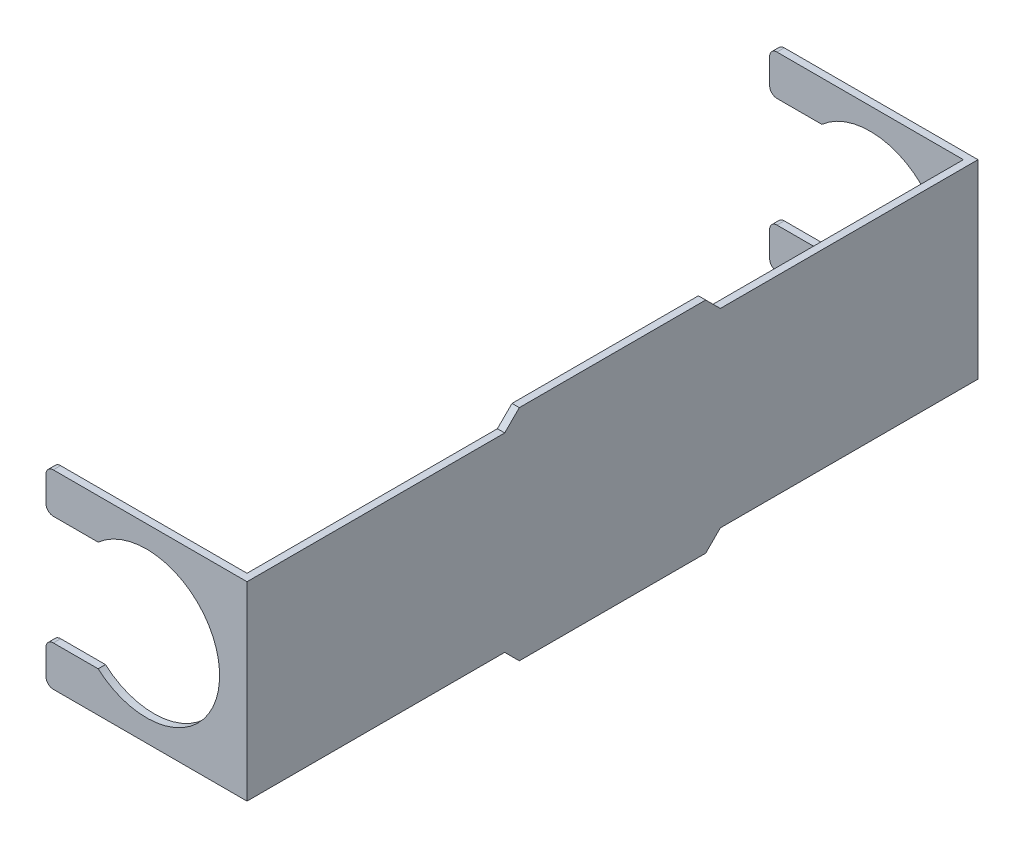
ISO-10303-21;
HEADER;
FILE_DESCRIPTION(('STEP AP214'),'2;1');
FILE_NAME('part.step','',(''),(''),'','','');
FILE_SCHEMA(('AUTOMOTIVE_DESIGN { 1 0 10303 214 1 1 1 1 }'));
ENDSEC;
DATA;
#1=APPLICATION_CONTEXT('core data for automotive mechanical design processes');
#2=APPLICATION_PROTOCOL_DEFINITION('international standard','automotive_design',2000,#1);
#3=PRODUCT_CONTEXT('',#1,'mechanical');
#4=PRODUCT('Part','Part','',(#3));
#5=PRODUCT_RELATED_PRODUCT_CATEGORY('part','',(#4));
#6=PRODUCT_DEFINITION_FORMATION('','',#4);
#7=PRODUCT_DEFINITION_CONTEXT('part definition',#1,'design');
#8=PRODUCT_DEFINITION('design','',#6,#7);
#9=PRODUCT_DEFINITION_SHAPE('','',#8);
#10=(LENGTH_UNIT() NAMED_UNIT(*) SI_UNIT(.MILLI.,.METRE.));
#11=(NAMED_UNIT(*) PLANE_ANGLE_UNIT() SI_UNIT($,.RADIAN.));
#12=(NAMED_UNIT(*) SI_UNIT($,.STERADIAN.) SOLID_ANGLE_UNIT());
#13=UNCERTAINTY_MEASURE_WITH_UNIT(LENGTH_MEASURE(1.E-05),#10,'distance_accuracy_value','');
#14=(GEOMETRIC_REPRESENTATION_CONTEXT(3) GLOBAL_UNCERTAINTY_ASSIGNED_CONTEXT((#13)) GLOBAL_UNIT_ASSIGNED_CONTEXT((#10,
#11,#12)) REPRESENTATION_CONTEXT('',''));
#15=CARTESIAN_POINT('',(0.,0.,0.));
#16=DIRECTION('',(0.,0.,1.));
#17=DIRECTION('',(1.,0.,0.));
#18=AXIS2_PLACEMENT_3D('',#15,#16,#17);
#19=CARTESIAN_POINT('',(-5.5,-6.,40.));
#20=DIRECTION('',(1.,0.,0.));
#21=DIRECTION('',(0.,0.,-1.));
#22=AXIS2_PLACEMENT_3D('',#19,#20,#21);
#23=PLANE('',#22);
#24=DIRECTION('',(0.,1.,0.));
#25=VECTOR('',#24,1.);
#26=CARTESIAN_POINT('',(-5.5,-6.,0.400000000000005));
#27=LINE('',#26,#25);
#28=CARTESIAN_POINT('',(-5.5,-4.8,0.400000000000005));
#29=VERTEX_POINT('',#28);
#30=CARTESIAN_POINT('',(-5.5,-3.4,0.400000000000005));
#31=VERTEX_POINT('',#30);
#32=EDGE_CURVE('E353',#29,#31,#27,.T.);
#33=ORIENTED_EDGE('',*,*,#32,.T.);
#34=DIRECTION('',(0.,0.,-1.));
#35=VECTOR('',#34,1.);
#36=CARTESIAN_POINT('',(-5.5,-3.4,40.));
#37=LINE('',#36,#35);
#38=CARTESIAN_POINT('',(-5.5,-3.4,0.));
#39=VERTEX_POINT('',#38);
#40=EDGE_CURVE('E478',#31,#39,#37,.T.);
#41=ORIENTED_EDGE('',*,*,#40,.T.);
#42=DIRECTION('',(0.,-1.,0.));
#43=VECTOR('',#42,1.);
#44=CARTESIAN_POINT('',(-5.5,-6.,0.));
#45=LINE('',#44,#43);
#46=CARTESIAN_POINT('',(-5.5,-4.8,0.));
#47=VERTEX_POINT('',#46);
#48=EDGE_CURVE('E375',#39,#47,#45,.T.);
#49=ORIENTED_EDGE('',*,*,#48,.T.);
#50=DIRECTION('',(0.,0.,1.));
#51=VECTOR('',#50,1.);
#52=CARTESIAN_POINT('',(-5.5,-4.8,0.400000000000005));
#53=LINE('',#52,#51);
#54=EDGE_CURVE('E475',#47,#29,#53,.T.);
#55=ORIENTED_EDGE('',*,*,#54,.T.);
#56=EDGE_LOOP('',(#33,#41,#49,#55));
#57=FACE_BOUND('',#56,.T.);
#58=ADVANCED_FACE('F42',(#57),#23,.F.);
#59=DIRECTION('',(0.,-1.,0.));
#60=VECTOR('',#59,1.);
#61=CARTESIAN_POINT('',(-5.5,-6.,40.));
#62=LINE('',#61,#60);
#63=CARTESIAN_POINT('',(-5.5,-3.4,40.));
#64=VERTEX_POINT('',#63);
#65=CARTESIAN_POINT('',(-5.5,-4.8,40.));
#66=VERTEX_POINT('',#65);
#67=EDGE_CURVE('E369',#64,#66,#62,.T.);
#68=ORIENTED_EDGE('',*,*,#67,.F.);
#69=DIRECTION('',(0.,0.,-1.));
#70=VECTOR('',#69,1.);
#71=CARTESIAN_POINT('',(-5.5,-3.4,40.));
#72=LINE('',#71,#70);
#73=CARTESIAN_POINT('',(-5.49999999999999,-3.4,39.6));
#74=VERTEX_POINT('',#73);
#75=EDGE_CURVE('E447',#64,#74,#72,.T.);
#76=ORIENTED_EDGE('',*,*,#75,.T.);
#77=DIRECTION('',(0.,1.,0.));
#78=VECTOR('',#77,1.);
#79=CARTESIAN_POINT('',(-5.49999999999999,-6.,39.6));
#80=LINE('',#79,#78);
#81=CARTESIAN_POINT('',(-5.49999999999999,-4.8,39.6));
#82=VERTEX_POINT('',#81);
#83=EDGE_CURVE('E363',#82,#74,#80,.T.);
#84=ORIENTED_EDGE('',*,*,#83,.F.);
#85=DIRECTION('',(0.,0.,1.));
#86=VECTOR('',#85,1.);
#87=CARTESIAN_POINT('',(-5.5,-4.8,40.));
#88=LINE('',#87,#86);
#89=EDGE_CURVE('E444',#82,#66,#88,.T.);
#90=ORIENTED_EDGE('',*,*,#89,.T.);
#91=EDGE_LOOP('',(#68,#76,#84,#90));
#92=FACE_BOUND('',#91,.T.);
#93=ADVANCED_FACE('F540',(#92),#23,.F.);
#94=CARTESIAN_POINT('',(-5.5,4.8,0.));
#95=VERTEX_POINT('',#94);
#96=CARTESIAN_POINT('',(-5.5,3.4,0.));
#97=VERTEX_POINT('',#96);
#98=EDGE_CURVE('E370',#95,#97,#45,.T.);
#99=ORIENTED_EDGE('',*,*,#98,.T.);
#100=DIRECTION('',(0.,0.,-1.));
#101=VECTOR('',#100,1.);
#102=CARTESIAN_POINT('',(-5.5,3.4,40.));
#103=LINE('',#102,#101);
#104=CARTESIAN_POINT('',(-5.5,3.4,0.400000000000005));
#105=VERTEX_POINT('',#104);
#106=EDGE_CURVE('E467',#97,#105,#103,.F.);
#107=ORIENTED_EDGE('',*,*,#106,.T.);
#108=CARTESIAN_POINT('',(-5.5,4.8,0.400000000000005));
#109=VERTEX_POINT('',#108);
#110=EDGE_CURVE('E357',#105,#109,#27,.T.);
#111=ORIENTED_EDGE('',*,*,#110,.T.);
#112=DIRECTION('',(0.,0.,1.));
#113=VECTOR('',#112,1.);
#114=CARTESIAN_POINT('',(-5.5,4.8,0.));
#115=LINE('',#114,#113);
#116=EDGE_CURVE('E465',#109,#95,#115,.F.);
#117=ORIENTED_EDGE('',*,*,#116,.T.);
#118=EDGE_LOOP('',(#99,#107,#111,#117));
#119=FACE_BOUND('',#118,.T.);
#120=ADVANCED_FACE('F526',(#119),#23,.F.);
#121=CARTESIAN_POINT('',(-5.5,4.8,40.));
#122=VERTEX_POINT('',#121);
#123=CARTESIAN_POINT('',(-5.5,3.4,40.));
#124=VERTEX_POINT('',#123);
#125=EDGE_CURVE('E371',#122,#124,#62,.T.);
#126=ORIENTED_EDGE('',*,*,#125,.F.);
#127=DIRECTION('',(0.,0.,1.));
#128=VECTOR('',#127,1.);
#129=CARTESIAN_POINT('',(-5.5,4.8,39.6));
#130=LINE('',#129,#128);
#131=CARTESIAN_POINT('',(-5.49999999999999,4.8,39.6));
#132=VERTEX_POINT('',#131);
#133=EDGE_CURVE('E432',#122,#132,#130,.F.);
#134=ORIENTED_EDGE('',*,*,#133,.T.);
#135=CARTESIAN_POINT('',(-5.49999999999999,3.4,39.6));
#136=VERTEX_POINT('',#135);
#137=EDGE_CURVE('E350',#136,#132,#80,.T.);
#138=ORIENTED_EDGE('',*,*,#137,.F.);
#139=DIRECTION('',(0.,0.,-1.));
#140=VECTOR('',#139,1.);
#141=CARTESIAN_POINT('',(-5.5,3.4,40.));
#142=LINE('',#141,#140);
#143=EDGE_CURVE('E430',#136,#124,#142,.F.);
#144=ORIENTED_EDGE('',*,*,#143,.T.);
#145=EDGE_LOOP('',(#126,#134,#138,#144));
#146=FACE_BOUND('',#145,.T.);
#147=ADVANCED_FACE('F546',(#146),#23,.F.);
#148=CARTESIAN_POINT('',(0.,0.,40.));
#149=DIRECTION('',(0.,0.,-1.));
#150=DIRECTION('',(-1.,0.,0.));
#151=AXIS2_PLACEMENT_3D('',#148,#149,#150);
#152=PLANE('',#151);
#153=DIRECTION('',(1.,0.,0.));
#154=VECTOR('',#153,1.);
#155=CARTESIAN_POINT('',(-5.49999999999999,5.2,40.));
#156=LINE('',#155,#154);
#157=CARTESIAN_POINT('',(-5.1,5.2,40.));
#158=VERTEX_POINT('',#157);
#159=CARTESIAN_POINT('',(5.5,5.2,40.));
#160=VERTEX_POINT('',#159);
#161=EDGE_CURVE('E323',#158,#160,#156,.T.);
#162=ORIENTED_EDGE('',*,*,#161,.F.);
#163=CARTESIAN_POINT('',(-5.1,4.8,40.));
#164=DIRECTION('',(0.,0.,-1.));
#165=DIRECTION('',(-1.,0.,0.));
#166=AXIS2_PLACEMENT_3D('',#163,#164,#165);
#167=CIRCLE('',#166,0.4);
#168=EDGE_CURVE('E428',#158,#122,#167,.F.);
#169=ORIENTED_EDGE('',*,*,#168,.T.);
#170=ORIENTED_EDGE('',*,*,#125,.T.);
#171=CARTESIAN_POINT('',(-5.1,3.4,40.));
#172=DIRECTION('',(0.,0.,-1.));
#173=DIRECTION('',(-1.,0.,0.));
#174=AXIS2_PLACEMENT_3D('',#171,#172,#173);
#175=CIRCLE('',#174,0.4);
#176=CARTESIAN_POINT('',(-5.1,3.,40.));
#177=VERTEX_POINT('',#176);
#178=EDGE_CURVE('E261',#124,#177,#175,.F.);
#179=ORIENTED_EDGE('',*,*,#178,.T.);
#180=DIRECTION('',(1.,0.,0.));
#181=VECTOR('',#180,1.);
#182=CARTESIAN_POINT('',(-5.5,3.,40.));
#183=LINE('',#182,#181);
#184=CARTESIAN_POINT('',(-2.64575131106459,3.,40.));
#185=VERTEX_POINT('',#184);
#186=EDGE_CURVE('E252',#177,#185,#183,.T.);
#187=ORIENTED_EDGE('',*,*,#186,.T.);
#188=CARTESIAN_POINT('',(0.,0.,40.));
#189=DIRECTION('',(0.,0.,-1.));
#190=DIRECTION('',(-1.,0.,0.));
#191=AXIS2_PLACEMENT_3D('',#188,#189,#190);
#192=CIRCLE('',#191,4.);
#193=CARTESIAN_POINT('',(-2.64575131106459,-3.,40.));
#194=VERTEX_POINT('',#193);
#195=EDGE_CURVE('E258',#185,#194,#192,.T.);
#196=ORIENTED_EDGE('',*,*,#195,.T.);
#197=DIRECTION('',(-1.,0.,0.));
#198=VECTOR('',#197,1.);
#199=CARTESIAN_POINT('',(-5.5,-3.,40.));
#200=LINE('',#199,#198);
#201=CARTESIAN_POINT('',(-5.1,-3.,40.));
#202=VERTEX_POINT('',#201);
#203=EDGE_CURVE('E282',#194,#202,#200,.T.);
#204=ORIENTED_EDGE('',*,*,#203,.T.);
#205=CARTESIAN_POINT('',(-5.1,-3.4,40.));
#206=DIRECTION('',(0.,0.,-1.));
#207=DIRECTION('',(-1.,0.,0.));
#208=AXIS2_PLACEMENT_3D('',#205,#206,#207);
#209=CIRCLE('',#208,0.4);
#210=EDGE_CURVE('E425',#202,#64,#209,.F.);
#211=ORIENTED_EDGE('',*,*,#210,.T.);
#212=ORIENTED_EDGE('',*,*,#67,.T.);
#213=CARTESIAN_POINT('',(-5.1,-4.8,40.));
#214=DIRECTION('',(0.,0.,-1.));
#215=DIRECTION('',(-1.,0.,0.));
#216=AXIS2_PLACEMENT_3D('',#213,#214,#215);
#217=CIRCLE('',#216,0.4);
#218=CARTESIAN_POINT('',(-5.1,-5.2,40.));
#219=VERTEX_POINT('',#218);
#220=EDGE_CURVE('E423',#66,#219,#217,.F.);
#221=ORIENTED_EDGE('',*,*,#220,.T.);
#222=DIRECTION('',(1.,0.,0.));
#223=VECTOR('',#222,1.);
#224=CARTESIAN_POINT('',(-5.49999999999999,-5.2,40.));
#225=LINE('',#224,#223);
#226=CARTESIAN_POINT('',(5.5,-5.2,40.));
#227=VERTEX_POINT('',#226);
#228=EDGE_CURVE('E317',#219,#227,#225,.T.);
#229=ORIENTED_EDGE('',*,*,#228,.T.);
#230=DIRECTION('',(0.,1.,0.));
#231=VECTOR('',#230,1.);
#232=CARTESIAN_POINT('',(5.5,-6.,40.));
#233=LINE('',#232,#231);
#234=EDGE_CURVE('E366',#227,#160,#233,.T.);
#235=ORIENTED_EDGE('',*,*,#234,.T.);
#236=EDGE_LOOP('',(#162,#169,#170,#179,#187,#196,#204,#211,#212,#221,#229,#235));
#237=FACE_BOUND('',#236,.T.);
#238=ADVANCED_FACE('F255',(#237),#152,.F.);
#239=CARTESIAN_POINT('',(0.,0.,0.));
#240=DIRECTION('',(0.,0.,-1.));
#241=DIRECTION('',(-1.,0.,0.));
#242=AXIS2_PLACEMENT_3D('',#239,#240,#241);
#243=PLANE('',#242);
#244=DIRECTION('',(1.,0.,0.));
#245=VECTOR('',#244,1.);
#246=CARTESIAN_POINT('',(-5.5,3.,0.));
#247=LINE('',#246,#245);
#248=CARTESIAN_POINT('',(-5.1,3.,0.));
#249=VERTEX_POINT('',#248);
#250=CARTESIAN_POINT('',(-2.64575131106459,3.,0.));
#251=VERTEX_POINT('',#250);
#252=EDGE_CURVE('E286',#249,#251,#247,.T.);
#253=ORIENTED_EDGE('',*,*,#252,.F.);
#254=CARTESIAN_POINT('',(-5.1,3.4,0.));
#255=DIRECTION('',(0.,0.,-1.));
#256=DIRECTION('',(-1.,0.,0.));
#257=AXIS2_PLACEMENT_3D('',#254,#255,#256);
#258=CIRCLE('',#257,0.4);
#259=EDGE_CURVE('E463',#249,#97,#258,.T.);
#260=ORIENTED_EDGE('',*,*,#259,.T.);
#261=ORIENTED_EDGE('',*,*,#98,.F.);
#262=CARTESIAN_POINT('',(-5.1,4.8,0.));
#263=DIRECTION('',(0.,0.,-1.));
#264=DIRECTION('',(-1.,0.,0.));
#265=AXIS2_PLACEMENT_3D('',#262,#263,#264);
#266=CIRCLE('',#265,0.4);
#267=CARTESIAN_POINT('',(-5.1,5.2,0.));
#268=VERTEX_POINT('',#267);
#269=EDGE_CURVE('E457',#95,#268,#266,.T.);
#270=ORIENTED_EDGE('',*,*,#269,.T.);
#271=DIRECTION('',(-1.,0.,0.));
#272=VECTOR('',#271,1.);
#273=CARTESIAN_POINT('',(-5.5,5.2,0.));
#274=LINE('',#273,#272);
#275=CARTESIAN_POINT('',(5.5,5.2,0.));
#276=VERTEX_POINT('',#275);
#277=EDGE_CURVE('E337',#276,#268,#274,.T.);
#278=ORIENTED_EDGE('',*,*,#277,.F.);
#279=DIRECTION('',(0.,1.,0.));
#280=VECTOR('',#279,1.);
#281=CARTESIAN_POINT('',(5.5,-6.,0.));
#282=LINE('',#281,#280);
#283=CARTESIAN_POINT('',(5.5,-5.2,0.));
#284=VERTEX_POINT('',#283);
#285=EDGE_CURVE('E356',#284,#276,#282,.T.);
#286=ORIENTED_EDGE('',*,*,#285,.F.);
#287=DIRECTION('',(-1.,0.,0.));
#288=VECTOR('',#287,1.);
#289=CARTESIAN_POINT('',(-5.5,-5.2,0.));
#290=LINE('',#289,#288);
#291=CARTESIAN_POINT('',(-5.1,-5.2,0.));
#292=VERTEX_POINT('',#291);
#293=EDGE_CURVE('E302',#284,#292,#290,.T.);
#294=ORIENTED_EDGE('',*,*,#293,.T.);
#295=CARTESIAN_POINT('',(-5.1,-4.8,0.));
#296=DIRECTION('',(0.,0.,-1.));
#297=DIRECTION('',(-1.,0.,0.));
#298=AXIS2_PLACEMENT_3D('',#295,#296,#297);
#299=CIRCLE('',#298,0.4);
#300=EDGE_CURVE('E459',#292,#47,#299,.T.);
#301=ORIENTED_EDGE('',*,*,#300,.T.);
#302=ORIENTED_EDGE('',*,*,#48,.F.);
#303=CARTESIAN_POINT('',(-5.1,-3.4,0.));
#304=DIRECTION('',(0.,0.,-1.));
#305=DIRECTION('',(-1.,0.,0.));
#306=AXIS2_PLACEMENT_3D('',#303,#304,#305);
#307=CIRCLE('',#306,0.4);
#308=CARTESIAN_POINT('',(-5.1,-3.,0.));
#309=VERTEX_POINT('',#308);
#310=EDGE_CURVE('E461',#39,#309,#307,.T.);
#311=ORIENTED_EDGE('',*,*,#310,.T.);
#312=DIRECTION('',(-1.,0.,0.));
#313=VECTOR('',#312,1.);
#314=CARTESIAN_POINT('',(-5.5,-3.,0.));
#315=LINE('',#314,#313);
#316=CARTESIAN_POINT('',(-2.64575131106459,-3.,0.));
#317=VERTEX_POINT('',#316);
#318=EDGE_CURVE('E265',#317,#309,#315,.T.);
#319=ORIENTED_EDGE('',*,*,#318,.F.);
#320=CARTESIAN_POINT('',(0.,0.,0.));
#321=DIRECTION('',(0.,0.,-1.));
#322=DIRECTION('',(-1.,0.,0.));
#323=AXIS2_PLACEMENT_3D('',#320,#321,#322);
#324=CIRCLE('',#323,4.);
#325=EDGE_CURVE('E288',#251,#317,#324,.T.);
#326=ORIENTED_EDGE('',*,*,#325,.F.);
#327=EDGE_LOOP('',(#253,#260,#261,#270,#278,#286,#294,#301,#302,#311,#319,#326));
#328=FACE_BOUND('',#327,.T.);
#329=ADVANCED_FACE('F491',(#328),#243,.T.);
#330=CARTESIAN_POINT('',(-5.5,-6.,0.400000000000005));
#331=DIRECTION('',(0.,0.,-1.));
#332=DIRECTION('',(-1.,0.,0.));
#333=AXIS2_PLACEMENT_3D('',#330,#331,#332);
#334=PLANE('',#333);
#335=ORIENTED_EDGE('',*,*,#110,.F.);
#336=CARTESIAN_POINT('',(-5.1,3.4,0.400000000000005));
#337=DIRECTION('',(0.,0.,-1.));
#338=DIRECTION('',(-1.,0.,0.));
#339=AXIS2_PLACEMENT_3D('',#336,#337,#338);
#340=CIRCLE('',#339,0.4);
#341=CARTESIAN_POINT('',(-5.1,3.,0.400000000000004));
#342=VERTEX_POINT('',#341);
#343=EDGE_CURVE('E473',#105,#342,#340,.F.);
#344=ORIENTED_EDGE('',*,*,#343,.T.);
#345=DIRECTION('',(1.,0.,0.));
#346=VECTOR('',#345,1.);
#347=CARTESIAN_POINT('',(-5.5,3.,0.400000000000005));
#348=LINE('',#347,#346);
#349=CARTESIAN_POINT('',(-2.64575131106459,3.,0.400000000000003));
#350=VERTEX_POINT('',#349);
#351=EDGE_CURVE('E293',#342,#350,#348,.T.);
#352=ORIENTED_EDGE('',*,*,#351,.T.);
#353=CARTESIAN_POINT('',(0.,0.,0.400000000000005));
#354=DIRECTION('',(0.,0.,-1.));
#355=DIRECTION('',(-1.,0.,0.));
#356=AXIS2_PLACEMENT_3D('',#353,#354,#355);
#357=CIRCLE('',#356,4.);
#358=CARTESIAN_POINT('',(-2.64575131106459,-3.,0.400000000000005));
#359=VERTEX_POINT('',#358);
#360=EDGE_CURVE('E296',#350,#359,#357,.T.);
#361=ORIENTED_EDGE('',*,*,#360,.T.);
#362=DIRECTION('',(-1.,0.,0.));
#363=VECTOR('',#362,1.);
#364=CARTESIAN_POINT('',(-5.5,-3.,0.400000000000005));
#365=LINE('',#364,#363);
#366=CARTESIAN_POINT('',(-5.1,-3.,0.400000000000004));
#367=VERTEX_POINT('',#366);
#368=EDGE_CURVE('E299',#359,#367,#365,.T.);
#369=ORIENTED_EDGE('',*,*,#368,.T.);
#370=CARTESIAN_POINT('',(-5.1,-3.4,0.400000000000005));
#371=DIRECTION('',(0.,0.,-1.));
#372=DIRECTION('',(-1.,0.,0.));
#373=AXIS2_PLACEMENT_3D('',#370,#371,#372);
#374=CIRCLE('',#373,0.4);
#375=EDGE_CURVE('E471',#367,#31,#374,.F.);
#376=ORIENTED_EDGE('',*,*,#375,.T.);
#377=ORIENTED_EDGE('',*,*,#32,.F.);
#378=CARTESIAN_POINT('',(-5.1,-4.8,0.400000000000005));
#379=DIRECTION('',(0.,0.,-1.));
#380=DIRECTION('',(-1.,0.,0.));
#381=AXIS2_PLACEMENT_3D('',#378,#379,#380);
#382=CIRCLE('',#381,0.4);
#383=CARTESIAN_POINT('',(-5.1,-5.2,0.400000000000004));
#384=VERTEX_POINT('',#383);
#385=EDGE_CURVE('E64',#29,#384,#382,.F.);
#386=ORIENTED_EDGE('',*,*,#385,.T.);
#387=DIRECTION('',(-1.,0.,0.));
#388=VECTOR('',#387,1.);
#389=CARTESIAN_POINT('',(-5.5,-5.2,0.400000000000005));
#390=LINE('',#389,#388);
#391=CARTESIAN_POINT('',(5.1,-5.2,0.4));
#392=VERTEX_POINT('',#391);
#393=EDGE_CURVE('E319',#392,#384,#390,.T.);
#394=ORIENTED_EDGE('',*,*,#393,.F.);
#395=DIRECTION('',(0.,1.,0.));
#396=VECTOR('',#395,1.);
#397=CARTESIAN_POINT('',(5.1,-6.,0.4));
#398=LINE('',#397,#396);
#399=CARTESIAN_POINT('',(5.1,5.2,0.4));
#400=VERTEX_POINT('',#399);
#401=EDGE_CURVE('E358',#392,#400,#398,.T.);
#402=ORIENTED_EDGE('',*,*,#401,.T.);
#403=DIRECTION('',(1.,0.,0.));
#404=VECTOR('',#403,1.);
#405=CARTESIAN_POINT('',(-5.5,5.2,0.400000000000005));
#406=LINE('',#405,#404);
#407=CARTESIAN_POINT('',(-5.1,5.2,0.400000000000004));
#408=VERTEX_POINT('',#407);
#409=EDGE_CURVE('E344',#408,#400,#406,.T.);
#410=ORIENTED_EDGE('',*,*,#409,.F.);
#411=CARTESIAN_POINT('',(-5.1,4.8,0.400000000000004));
#412=DIRECTION('',(0.,0.,-1.));
#413=DIRECTION('',(-1.,0.,0.));
#414=AXIS2_PLACEMENT_3D('',#411,#412,#413);
#415=CIRCLE('',#414,0.4);
#416=EDGE_CURVE('E57',#408,#109,#415,.F.);
#417=ORIENTED_EDGE('',*,*,#416,.T.);
#418=EDGE_LOOP('',(#335,#344,#352,#361,#369,#376,#377,#386,#394,#402,#410,#417));
#419=FACE_BOUND('',#418,.T.);
#420=ADVANCED_FACE('F499',(#419),#334,.F.);
#421=CARTESIAN_POINT('',(-5.49999999999999,-6.,39.6));
#422=DIRECTION('',(0.,0.,1.));
#423=DIRECTION('',(1.,0.,0.));
#424=AXIS2_PLACEMENT_3D('',#421,#422,#423);
#425=PLANE('',#424);
#426=ORIENTED_EDGE('',*,*,#137,.T.);
#427=CARTESIAN_POINT('',(-5.1,4.8,39.6));
#428=DIRECTION('',(0.,0.,1.));
#429=DIRECTION('',(1.,0.,0.));
#430=AXIS2_PLACEMENT_3D('',#427,#428,#429);
#431=CIRCLE('',#430,0.4);
#432=CARTESIAN_POINT('',(-5.1,5.2,39.6));
#433=VERTEX_POINT('',#432);
#434=EDGE_CURVE('E440',#132,#433,#431,.F.);
#435=ORIENTED_EDGE('',*,*,#434,.T.);
#436=DIRECTION('',(-1.,0.,0.));
#437=VECTOR('',#436,1.);
#438=CARTESIAN_POINT('',(-5.49999999999999,5.2,39.6));
#439=LINE('',#438,#437);
#440=CARTESIAN_POINT('',(5.1,5.2,39.6));
#441=VERTEX_POINT('',#440);
#442=EDGE_CURVE('E383',#441,#433,#439,.T.);
#443=ORIENTED_EDGE('',*,*,#442,.F.);
#444=DIRECTION('',(0.,1.,0.));
#445=VECTOR('',#444,1.);
#446=CARTESIAN_POINT('',(5.1,-6.,39.6));
#447=LINE('',#446,#445);
#448=CARTESIAN_POINT('',(5.1,-5.2,39.6));
#449=VERTEX_POINT('',#448);
#450=EDGE_CURVE('E361',#449,#441,#447,.T.);
#451=ORIENTED_EDGE('',*,*,#450,.F.);
#452=DIRECTION('',(1.,0.,0.));
#453=VECTOR('',#452,1.);
#454=CARTESIAN_POINT('',(-5.49999999999999,-5.2,39.6));
#455=LINE('',#454,#453);
#456=CARTESIAN_POINT('',(-5.1,-5.2,39.6));
#457=VERTEX_POINT('',#456);
#458=EDGE_CURVE('E321',#457,#449,#455,.T.);
#459=ORIENTED_EDGE('',*,*,#458,.F.);
#460=CARTESIAN_POINT('',(-5.1,-4.8,39.6));
#461=DIRECTION('',(0.,0.,1.));
#462=DIRECTION('',(1.,0.,0.));
#463=AXIS2_PLACEMENT_3D('',#460,#461,#462);
#464=CIRCLE('',#463,0.4);
#465=EDGE_CURVE('E434',#457,#82,#464,.F.);
#466=ORIENTED_EDGE('',*,*,#465,.T.);
#467=ORIENTED_EDGE('',*,*,#83,.T.);
#468=CARTESIAN_POINT('',(-5.1,-3.4,39.6));
#469=DIRECTION('',(0.,0.,1.));
#470=DIRECTION('',(1.,0.,0.));
#471=AXIS2_PLACEMENT_3D('',#468,#469,#470);
#472=CIRCLE('',#471,0.4);
#473=CARTESIAN_POINT('',(-5.1,-3.,39.6));
#474=VERTEX_POINT('',#473);
#475=EDGE_CURVE('E436',#74,#474,#472,.F.);
#476=ORIENTED_EDGE('',*,*,#475,.T.);
#477=DIRECTION('',(1.,0.,0.));
#478=VECTOR('',#477,1.);
#479=CARTESIAN_POINT('',(-5.49999999999999,-3.,39.6));
#480=LINE('',#479,#478);
#481=CARTESIAN_POINT('',(-2.64575131106459,-3.,39.6));
#482=VERTEX_POINT('',#481);
#483=EDGE_CURVE('E418',#474,#482,#480,.T.);
#484=ORIENTED_EDGE('',*,*,#483,.T.);
#485=CARTESIAN_POINT('',(0.,0.,39.6));
#486=DIRECTION('',(0.,0.,1.));
#487=DIRECTION('',(1.,0.,0.));
#488=AXIS2_PLACEMENT_3D('',#485,#486,#487);
#489=CIRCLE('',#488,4.);
#490=CARTESIAN_POINT('',(-2.64575131106459,3.,39.6));
#491=VERTEX_POINT('',#490);
#492=EDGE_CURVE('E416',#482,#491,#489,.T.);
#493=ORIENTED_EDGE('',*,*,#492,.T.);
#494=DIRECTION('',(-1.,0.,0.));
#495=VECTOR('',#494,1.);
#496=CARTESIAN_POINT('',(-5.49999999999999,3.,39.6));
#497=LINE('',#496,#495);
#498=CARTESIAN_POINT('',(-5.1,3.,39.6));
#499=VERTEX_POINT('',#498);
#500=EDGE_CURVE('E271',#491,#499,#497,.T.);
#501=ORIENTED_EDGE('',*,*,#500,.T.);
#502=CARTESIAN_POINT('',(-5.1,3.4,39.6));
#503=DIRECTION('',(0.,0.,1.));
#504=DIRECTION('',(1.,0.,0.));
#505=AXIS2_PLACEMENT_3D('',#502,#503,#504);
#506=CIRCLE('',#505,0.4);
#507=EDGE_CURVE('E438',#499,#136,#506,.F.);
#508=ORIENTED_EDGE('',*,*,#507,.T.);
#509=EDGE_LOOP('',(#426,#435,#443,#451,#459,#466,#467,#476,#484,#493,#501,#508));
#510=FACE_BOUND('',#509,.T.);
#511=ADVANCED_FACE('F569',(#510),#425,.F.);
#512=CARTESIAN_POINT('',(5.5,-6.,40.));
#513=DIRECTION('',(-1.,0.,0.));
#514=DIRECTION('',(0.,0.,1.));
#515=AXIS2_PLACEMENT_3D('',#512,#513,#514);
#516=PLANE('',#515);
#517=DIRECTION('',(0.,0.,-1.));
#518=VECTOR('',#517,1.);
#519=CARTESIAN_POINT('',(5.5,-5.2,25.9));
#520=LINE('',#519,#518);
#521=CARTESIAN_POINT('',(5.5,-5.2,25.9));
#522=VERTEX_POINT('',#521);
#523=EDGE_CURVE('E314',#227,#522,#520,.T.);
#524=ORIENTED_EDGE('',*,*,#523,.T.);
#525=DIRECTION('',(0.,-0.707106781186549,-0.707106781186546));
#526=VECTOR('',#525,1.);
#527=CARTESIAN_POINT('',(5.5,-6.,25.1));
#528=LINE('',#527,#526);
#529=CARTESIAN_POINT('',(5.5,-6.,25.1));
#530=VERTEX_POINT('',#529);
#531=EDGE_CURVE('E409',#522,#530,#528,.T.);
#532=ORIENTED_EDGE('',*,*,#531,.T.);
#533=DIRECTION('',(0.,0.,-1.));
#534=VECTOR('',#533,1.);
#535=CARTESIAN_POINT('',(5.5,-6.,40.));
#536=LINE('',#535,#534);
#537=CARTESIAN_POINT('',(5.5,-6.,14.9));
#538=VERTEX_POINT('',#537);
#539=EDGE_CURVE('E373',#530,#538,#536,.T.);
#540=ORIENTED_EDGE('',*,*,#539,.T.);
#541=DIRECTION('',(0.,0.707106781186548,-0.707106781186547));
#542=VECTOR('',#541,1.);
#543=CARTESIAN_POINT('',(5.5,-6.00000000000005,14.9));
#544=LINE('',#543,#542);
#545=CARTESIAN_POINT('',(5.5,-5.2,14.1));
#546=VERTEX_POINT('',#545);
#547=EDGE_CURVE('E407',#538,#546,#544,.T.);
#548=ORIENTED_EDGE('',*,*,#547,.T.);
#549=DIRECTION('',(0.,0.,-1.));
#550=VECTOR('',#549,1.);
#551=CARTESIAN_POINT('',(5.5,-5.2,0.));
#552=LINE('',#551,#550);
#553=EDGE_CURVE('E305',#546,#284,#552,.T.);
#554=ORIENTED_EDGE('',*,*,#553,.T.);
#555=ORIENTED_EDGE('',*,*,#285,.T.);
#556=DIRECTION('',(0.,0.,-1.));
#557=VECTOR('',#556,1.);
#558=CARTESIAN_POINT('',(5.5,5.2,0.));
#559=LINE('',#558,#557);
#560=CARTESIAN_POINT('',(5.5,5.2,14.1));
#561=VERTEX_POINT('',#560);
#562=EDGE_CURVE('E334',#561,#276,#559,.T.);
#563=ORIENTED_EDGE('',*,*,#562,.F.);
#564=DIRECTION('',(0.,-0.707106781186547,-0.707106781186548));
#565=VECTOR('',#564,1.);
#566=CARTESIAN_POINT('',(5.5,5.2,14.1));
#567=LINE('',#566,#565);
#568=CARTESIAN_POINT('',(5.5,6.,14.9));
#569=VERTEX_POINT('',#568);
#570=EDGE_CURVE('E403',#561,#569,#567,.F.);
#571=ORIENTED_EDGE('',*,*,#570,.T.);
#572=DIRECTION('',(0.,0.,-1.));
#573=VECTOR('',#572,1.);
#574=CARTESIAN_POINT('',(5.5,6.,40.));
#575=LINE('',#574,#573);
#576=CARTESIAN_POINT('',(5.5,6.,25.1));
#577=VERTEX_POINT('',#576);
#578=EDGE_CURVE('E380',#577,#569,#575,.T.);
#579=ORIENTED_EDGE('',*,*,#578,.F.);
#580=DIRECTION('',(0.,0.707106781186548,-0.707106781186548));
#581=VECTOR('',#580,1.);
#582=CARTESIAN_POINT('',(5.5,5.2,25.9));
#583=LINE('',#582,#581);
#584=CARTESIAN_POINT('',(5.5,5.2,25.9));
#585=VERTEX_POINT('',#584);
#586=EDGE_CURVE('E405',#577,#585,#583,.F.);
#587=ORIENTED_EDGE('',*,*,#586,.T.);
#588=DIRECTION('',(0.,0.,-1.));
#589=VECTOR('',#588,1.);
#590=CARTESIAN_POINT('',(5.5,5.2,25.9));
#591=LINE('',#590,#589);
#592=EDGE_CURVE('E325',#160,#585,#591,.T.);
#593=ORIENTED_EDGE('',*,*,#592,.F.);
#594=ORIENTED_EDGE('',*,*,#234,.F.);
#595=EDGE_LOOP('',(#524,#532,#540,#548,#554,#555,#563,#571,#579,#587,#593,#594));
#596=FACE_BOUND('',#595,.T.);
#597=ADVANCED_FACE('F624',(#596),#516,.F.);
#598=CARTESIAN_POINT('',(-5.5,-6.,40.));
#599=DIRECTION('',(0.,1.,0.));
#600=DIRECTION('',(0.,0.,1.));
#601=AXIS2_PLACEMENT_3D('',#598,#599,#600);
#602=PLANE('',#601);
#603=ORIENTED_EDGE('',*,*,#539,.F.);
#604=DIRECTION('',(-1.,0.,0.));
#605=VECTOR('',#604,1.);
#606=CARTESIAN_POINT('',(5.1,-6.,25.1));
#607=LINE('',#606,#605);
#608=CARTESIAN_POINT('',(5.1,-6.,25.1));
#609=VERTEX_POINT('',#608);
#610=EDGE_CURVE('E392',#530,#609,#607,.T.);
#611=ORIENTED_EDGE('',*,*,#610,.T.);
#612=DIRECTION('',(0.,0.,-1.));
#613=VECTOR('',#612,1.);
#614=CARTESIAN_POINT('',(5.1,-6.,0.4));
#615=LINE('',#614,#613);
#616=CARTESIAN_POINT('',(5.1,-6.,14.9));
#617=VERTEX_POINT('',#616);
#618=EDGE_CURVE('E347',#609,#617,#615,.T.);
#619=ORIENTED_EDGE('',*,*,#618,.T.);
#620=DIRECTION('',(1.,0.,0.));
#621=VECTOR('',#620,1.);
#622=CARTESIAN_POINT('',(5.5,-6.,14.9));
#623=LINE('',#622,#621);
#624=EDGE_CURVE('E389',#617,#538,#623,.T.);
#625=ORIENTED_EDGE('',*,*,#624,.T.);
#626=EDGE_LOOP('',(#603,#611,#619,#625));
#627=FACE_BOUND('',#626,.T.);
#628=ADVANCED_FACE('F622',(#627),#602,.F.);
#629=CARTESIAN_POINT('',(5.1,-6.,0.4));
#630=DIRECTION('',(1.,0.,0.));
#631=DIRECTION('',(0.,0.,-1.));
#632=AXIS2_PLACEMENT_3D('',#629,#630,#631);
#633=PLANE('',#632);
#634=ORIENTED_EDGE('',*,*,#618,.F.);
#635=DIRECTION('',(0.,0.707106781186549,0.707106781186546));
#636=VECTOR('',#635,1.);
#637=CARTESIAN_POINT('',(5.1,-6.,25.1));
#638=LINE('',#637,#636);
#639=CARTESIAN_POINT('',(5.1,-5.2,25.9));
#640=VERTEX_POINT('',#639);
#641=EDGE_CURVE('E401',#609,#640,#638,.T.);
#642=ORIENTED_EDGE('',*,*,#641,.T.);
#643=DIRECTION('',(0.,0.,-1.));
#644=VECTOR('',#643,1.);
#645=CARTESIAN_POINT('',(5.1,-5.2,0.4));
#646=LINE('',#645,#644);
#647=EDGE_CURVE('E388',#449,#640,#646,.T.);
#648=ORIENTED_EDGE('',*,*,#647,.F.);
#649=ORIENTED_EDGE('',*,*,#450,.T.);
#650=DIRECTION('',(0.,0.,1.));
#651=VECTOR('',#650,1.);
#652=CARTESIAN_POINT('',(5.1,5.2,0.4));
#653=LINE('',#652,#651);
#654=CARTESIAN_POINT('',(5.1,5.2,25.9));
#655=VERTEX_POINT('',#654);
#656=EDGE_CURVE('E340',#655,#441,#653,.T.);
#657=ORIENTED_EDGE('',*,*,#656,.F.);
#658=DIRECTION('',(0.,-0.707106781186548,0.707106781186548));
#659=VECTOR('',#658,1.);
#660=CARTESIAN_POINT('',(5.1,5.2,25.9));
#661=LINE('',#660,#659);
#662=CARTESIAN_POINT('',(5.1,6.,25.1));
#663=VERTEX_POINT('',#662);
#664=EDGE_CURVE('E397',#655,#663,#661,.F.);
#665=ORIENTED_EDGE('',*,*,#664,.T.);
#666=DIRECTION('',(0.,0.,-1.));
#667=VECTOR('',#666,1.);
#668=CARTESIAN_POINT('',(5.1,6.,0.4));
#669=LINE('',#668,#667);
#670=CARTESIAN_POINT('',(5.1,6.,14.9));
#671=VERTEX_POINT('',#670);
#672=EDGE_CURVE('E346',#663,#671,#669,.T.);
#673=ORIENTED_EDGE('',*,*,#672,.T.);
#674=DIRECTION('',(0.,0.707106781186547,0.707106781186548));
#675=VECTOR('',#674,1.);
#676=CARTESIAN_POINT('',(5.1,5.2,14.1));
#677=LINE('',#676,#675);
#678=CARTESIAN_POINT('',(5.1,5.2,14.1));
#679=VERTEX_POINT('',#678);
#680=EDGE_CURVE('E395',#671,#679,#677,.F.);
#681=ORIENTED_EDGE('',*,*,#680,.T.);
#682=EDGE_CURVE('E343',#400,#679,#653,.T.);
#683=ORIENTED_EDGE('',*,*,#682,.F.);
#684=ORIENTED_EDGE('',*,*,#401,.F.);
#685=CARTESIAN_POINT('',(5.1,-5.2,14.1));
#686=VERTEX_POINT('',#685);
#687=EDGE_CURVE('E386',#686,#392,#646,.T.);
#688=ORIENTED_EDGE('',*,*,#687,.F.);
#689=DIRECTION('',(0.,-0.707106781186548,0.707106781186547));
#690=VECTOR('',#689,1.);
#691=CARTESIAN_POINT('',(5.1,-6.00000000000005,14.9));
#692=LINE('',#691,#690);
#693=EDGE_CURVE('E399',#686,#617,#692,.T.);
#694=ORIENTED_EDGE('',*,*,#693,.T.);
#695=EDGE_LOOP('',(#634,#642,#648,#649,#657,#665,#673,#681,#683,#684,#688,#694));
#696=FACE_BOUND('',#695,.T.);
#697=ADVANCED_FACE('F577',(#696),#633,.F.);
#698=CARTESIAN_POINT('',(-5.5,6.,40.));
#699=DIRECTION('',(0.,-1.,0.));
#700=DIRECTION('',(0.,0.,-1.));
#701=AXIS2_PLACEMENT_3D('',#698,#699,#700);
#702=PLANE('',#701);
#703=ORIENTED_EDGE('',*,*,#672,.F.);
#704=DIRECTION('',(1.,0.,0.));
#705=VECTOR('',#704,1.);
#706=CARTESIAN_POINT('',(-5.5,6.,25.1));
#707=LINE('',#706,#705);
#708=EDGE_CURVE('E413',#663,#577,#707,.T.);
#709=ORIENTED_EDGE('',*,*,#708,.T.);
#710=ORIENTED_EDGE('',*,*,#578,.T.);
#711=DIRECTION('',(-1.,0.,0.));
#712=VECTOR('',#711,1.);
#713=CARTESIAN_POINT('',(-5.50000000000022,6.,14.9000000000001));
#714=LINE('',#713,#712);
#715=EDGE_CURVE('E411',#569,#671,#714,.T.);
#716=ORIENTED_EDGE('',*,*,#715,.T.);
#717=EDGE_LOOP('',(#703,#709,#710,#716));
#718=FACE_BOUND('',#717,.T.);
#719=ADVANCED_FACE('F621',(#718),#702,.F.);
#720=CARTESIAN_POINT('',(0.,5.2,0.));
#721=DIRECTION('',(0.,1.,0.));
#722=DIRECTION('',(0.,0.,1.));
#723=AXIS2_PLACEMENT_3D('',#720,#721,#722);
#724=PLANE('',#723);
#725=ORIENTED_EDGE('',*,*,#442,.T.);
#726=DIRECTION('',(0.,0.,1.));
#727=VECTOR('',#726,1.);
#728=CARTESIAN_POINT('',(-5.1,5.2,40.));
#729=LINE('',#728,#727);
#730=EDGE_CURVE('E420',#433,#158,#729,.T.);
#731=ORIENTED_EDGE('',*,*,#730,.T.);
#732=ORIENTED_EDGE('',*,*,#161,.T.);
#733=ORIENTED_EDGE('',*,*,#592,.T.);
#734=DIRECTION('',(-1.,0.,0.));
#735=VECTOR('',#734,1.);
#736=CARTESIAN_POINT('',(5.5,5.2,25.9));
#737=LINE('',#736,#735);
#738=EDGE_CURVE('E328',#585,#655,#737,.T.);
#739=ORIENTED_EDGE('',*,*,#738,.T.);
#740=ORIENTED_EDGE('',*,*,#656,.T.);
#741=EDGE_LOOP('',(#725,#731,#732,#733,#739,#740));
#742=FACE_BOUND('',#741,.T.);
#743=ADVANCED_FACE('F572',(#742),#724,.T.);
#744=ORIENTED_EDGE('',*,*,#277,.T.);
#745=DIRECTION('',(0.,0.,1.));
#746=VECTOR('',#745,1.);
#747=CARTESIAN_POINT('',(-5.1,5.2,0.400000000000002));
#748=LINE('',#747,#746);
#749=EDGE_CURVE('E11',#268,#408,#748,.T.);
#750=ORIENTED_EDGE('',*,*,#749,.T.);
#751=ORIENTED_EDGE('',*,*,#409,.T.);
#752=ORIENTED_EDGE('',*,*,#682,.T.);
#753=DIRECTION('',(1.,0.,0.));
#754=VECTOR('',#753,1.);
#755=CARTESIAN_POINT('',(5.5,5.2,14.1));
#756=LINE('',#755,#754);
#757=EDGE_CURVE('E331',#679,#561,#756,.T.);
#758=ORIENTED_EDGE('',*,*,#757,.T.);
#759=ORIENTED_EDGE('',*,*,#562,.T.);
#760=EDGE_LOOP('',(#744,#750,#751,#752,#758,#759));
#761=FACE_BOUND('',#760,.T.);
#762=ADVANCED_FACE('F532',(#761),#724,.T.);
#763=CARTESIAN_POINT('',(0.,-5.2,0.));
#764=DIRECTION('',(0.,-1.,0.));
#765=DIRECTION('',(0.,0.,1.));
#766=AXIS2_PLACEMENT_3D('',#763,#764,#765);
#767=PLANE('',#766);
#768=ORIENTED_EDGE('',*,*,#393,.T.);
#769=DIRECTION('',(0.,0.,1.));
#770=VECTOR('',#769,1.);
#771=CARTESIAN_POINT('',(-5.1,-5.2,0.));
#772=LINE('',#771,#770);
#773=EDGE_CURVE('E50',#384,#292,#772,.F.);
#774=ORIENTED_EDGE('',*,*,#773,.T.);
#775=ORIENTED_EDGE('',*,*,#293,.F.);
#776=ORIENTED_EDGE('',*,*,#553,.F.);
#777=DIRECTION('',(1.,0.,0.));
#778=VECTOR('',#777,1.);
#779=CARTESIAN_POINT('',(5.5,-5.2,14.1));
#780=LINE('',#779,#778);
#781=EDGE_CURVE('E308',#686,#546,#780,.T.);
#782=ORIENTED_EDGE('',*,*,#781,.F.);
#783=ORIENTED_EDGE('',*,*,#687,.T.);
#784=EDGE_LOOP('',(#768,#774,#775,#776,#782,#783));
#785=FACE_BOUND('',#784,.T.);
#786=ADVANCED_FACE('F484',(#785),#767,.T.);
#787=ORIENTED_EDGE('',*,*,#228,.F.);
#788=DIRECTION('',(0.,0.,1.));
#789=VECTOR('',#788,1.);
#790=CARTESIAN_POINT('',(-5.1,-5.2,39.6));
#791=LINE('',#790,#789);
#792=EDGE_CURVE('E452',#219,#457,#791,.F.);
#793=ORIENTED_EDGE('',*,*,#792,.T.);
#794=ORIENTED_EDGE('',*,*,#458,.T.);
#795=ORIENTED_EDGE('',*,*,#647,.T.);
#796=DIRECTION('',(-1.,0.,0.));
#797=VECTOR('',#796,1.);
#798=CARTESIAN_POINT('',(5.5,-5.2,25.9));
#799=LINE('',#798,#797);
#800=EDGE_CURVE('E311',#522,#640,#799,.T.);
#801=ORIENTED_EDGE('',*,*,#800,.F.);
#802=ORIENTED_EDGE('',*,*,#523,.F.);
#803=EDGE_LOOP('',(#787,#793,#794,#795,#801,#802));
#804=FACE_BOUND('',#803,.T.);
#805=ADVANCED_FACE('F611',(#804),#767,.T.);
#806=CARTESIAN_POINT('',(-5.5,-6.,25.1));
#807=DIRECTION('',(0.,-0.707106781186546,0.707106781186549));
#808=DIRECTION('',(1.,0.,0.));
#809=AXIS2_PLACEMENT_3D('',#806,#807,#808);
#810=PLANE('',#809);
#811=ORIENTED_EDGE('',*,*,#531,.F.);
#812=ORIENTED_EDGE('',*,*,#800,.T.);
#813=ORIENTED_EDGE('',*,*,#641,.F.);
#814=ORIENTED_EDGE('',*,*,#610,.F.);
#815=EDGE_LOOP('',(#811,#812,#813,#814));
#816=FACE_BOUND('',#815,.T.);
#817=ADVANCED_FACE('F614',(#816),#810,.T.);
#818=CARTESIAN_POINT('',(-5.50000000000022,-6.,14.9000000000001));
#819=DIRECTION('',(0.,-0.707106781186547,-0.707106781186548));
#820=DIRECTION('',(-1.,0.,0.));
#821=AXIS2_PLACEMENT_3D('',#818,#819,#820);
#822=PLANE('',#821);
#823=ORIENTED_EDGE('',*,*,#693,.F.);
#824=ORIENTED_EDGE('',*,*,#781,.T.);
#825=ORIENTED_EDGE('',*,*,#547,.F.);
#826=ORIENTED_EDGE('',*,*,#624,.F.);
#827=EDGE_LOOP('',(#823,#824,#825,#826));
#828=FACE_BOUND('',#827,.T.);
#829=ADVANCED_FACE('F656',(#828),#822,.T.);
#830=CARTESIAN_POINT('',(5.5,5.2,25.9));
#831=DIRECTION('',(0.,-0.707106781186548,-0.707106781186548));
#832=DIRECTION('',(-1.,0.,0.));
#833=AXIS2_PLACEMENT_3D('',#830,#831,#832);
#834=PLANE('',#833);
#835=ORIENTED_EDGE('',*,*,#586,.F.);
#836=ORIENTED_EDGE('',*,*,#708,.F.);
#837=ORIENTED_EDGE('',*,*,#664,.F.);
#838=ORIENTED_EDGE('',*,*,#738,.F.);
#839=EDGE_LOOP('',(#835,#836,#837,#838));
#840=FACE_BOUND('',#839,.T.);
#841=ADVANCED_FACE('F644',(#840),#834,.F.);
#842=CARTESIAN_POINT('',(5.5,5.2,14.1));
#843=DIRECTION('',(0.,-0.707106781186548,0.707106781186547));
#844=DIRECTION('',(1.,0.,0.));
#845=AXIS2_PLACEMENT_3D('',#842,#843,#844);
#846=PLANE('',#845);
#847=ORIENTED_EDGE('',*,*,#680,.F.);
#848=ORIENTED_EDGE('',*,*,#715,.F.);
#849=ORIENTED_EDGE('',*,*,#570,.F.);
#850=ORIENTED_EDGE('',*,*,#757,.F.);
#851=EDGE_LOOP('',(#847,#848,#849,#850));
#852=FACE_BOUND('',#851,.T.);
#853=ADVANCED_FACE('F652',(#852),#846,.F.);
#854=CARTESIAN_POINT('',(-5.5,3.,40.));
#855=DIRECTION('',(0.,1.,0.));
#856=DIRECTION('',(-1.,0.,0.));
#857=AXIS2_PLACEMENT_3D('',#854,#855,#856);
#858=PLANE('',#857);
#859=ORIENTED_EDGE('',*,*,#186,.F.);
#860=DIRECTION('',(0.,0.,-1.));
#861=VECTOR('',#860,1.);
#862=CARTESIAN_POINT('',(-5.1,3.,40.));
#863=LINE('',#862,#861);
#864=EDGE_CURVE('E442',#177,#499,#863,.T.);
#865=ORIENTED_EDGE('',*,*,#864,.T.);
#866=ORIENTED_EDGE('',*,*,#500,.F.);
#867=DIRECTION('',(0.,0.,-1.));
#868=VECTOR('',#867,1.);
#869=CARTESIAN_POINT('',(-2.64575131106459,3.,40.));
#870=LINE('',#869,#868);
#871=EDGE_CURVE('E268',#185,#491,#870,.T.);
#872=ORIENTED_EDGE('',*,*,#871,.F.);
#873=EDGE_LOOP('',(#859,#865,#866,#872));
#874=FACE_BOUND('',#873,.T.);
#875=ADVANCED_FACE('F269',(#874),#858,.F.);
#876=CARTESIAN_POINT('',(0.,0.,40.));
#877=DIRECTION('',(0.,0.,-1.));
#878=DIRECTION('',(-1.,0.,0.));
#879=AXIS2_PLACEMENT_3D('',#876,#877,#878);
#880=CYLINDRICAL_SURFACE('',#879,4.);
#881=DIRECTION('',(0.,0.,-1.));
#882=VECTOR('',#881,1.);
#883=CARTESIAN_POINT('',(-2.64575131106459,-3.,40.));
#884=LINE('',#883,#882);
#885=EDGE_CURVE('E280',#194,#482,#884,.T.);
#886=ORIENTED_EDGE('',*,*,#885,.F.);
#887=ORIENTED_EDGE('',*,*,#195,.F.);
#888=ORIENTED_EDGE('',*,*,#871,.T.);
#889=ORIENTED_EDGE('',*,*,#492,.F.);
#890=EDGE_LOOP('',(#886,#887,#888,#889));
#891=FACE_BOUND('',#890,.T.);
#892=ADVANCED_FACE('F278',(#891),#880,.F.);
#893=CARTESIAN_POINT('',(-5.5,-3.,40.));
#894=DIRECTION('',(0.,-1.,0.));
#895=DIRECTION('',(1.,0.,0.));
#896=AXIS2_PLACEMENT_3D('',#893,#894,#895);
#897=PLANE('',#896);
#898=ORIENTED_EDGE('',*,*,#483,.F.);
#899=DIRECTION('',(0.,0.,-1.));
#900=VECTOR('',#899,1.);
#901=CARTESIAN_POINT('',(-5.1,-3.,40.));
#902=LINE('',#901,#900);
#903=EDGE_CURVE('E450',#474,#202,#902,.F.);
#904=ORIENTED_EDGE('',*,*,#903,.T.);
#905=ORIENTED_EDGE('',*,*,#203,.F.);
#906=ORIENTED_EDGE('',*,*,#885,.T.);
#907=EDGE_LOOP('',(#898,#904,#905,#906));
#908=FACE_BOUND('',#907,.T.);
#909=ADVANCED_FACE('F599',(#908),#897,.F.);
#910=ORIENTED_EDGE('',*,*,#318,.T.);
#911=DIRECTION('',(0.,0.,-1.));
#912=VECTOR('',#911,1.);
#913=CARTESIAN_POINT('',(-5.1,-3.,40.));
#914=LINE('',#913,#912);
#915=EDGE_CURVE('E481',#309,#367,#914,.F.);
#916=ORIENTED_EDGE('',*,*,#915,.T.);
#917=ORIENTED_EDGE('',*,*,#368,.F.);
#918=EDGE_CURVE('E275',#359,#317,#884,.T.);
#919=ORIENTED_EDGE('',*,*,#918,.T.);
#920=EDGE_LOOP('',(#910,#916,#917,#919));
#921=FACE_BOUND('',#920,.T.);
#922=ADVANCED_FACE('F507',(#921),#897,.F.);
#923=EDGE_CURVE('E276',#350,#251,#870,.T.);
#924=ORIENTED_EDGE('',*,*,#923,.T.);
#925=ORIENTED_EDGE('',*,*,#325,.T.);
#926=ORIENTED_EDGE('',*,*,#918,.F.);
#927=ORIENTED_EDGE('',*,*,#360,.F.);
#928=EDGE_LOOP('',(#924,#925,#926,#927));
#929=FACE_BOUND('',#928,.T.);
#930=ADVANCED_FACE('F512',(#929),#880,.F.);
#931=ORIENTED_EDGE('',*,*,#351,.F.);
#932=DIRECTION('',(0.,0.,-1.));
#933=VECTOR('',#932,1.);
#934=CARTESIAN_POINT('',(-5.1,3.,40.));
#935=LINE('',#934,#933);
#936=EDGE_CURVE('E454',#342,#249,#935,.T.);
#937=ORIENTED_EDGE('',*,*,#936,.T.);
#938=ORIENTED_EDGE('',*,*,#252,.T.);
#939=ORIENTED_EDGE('',*,*,#923,.F.);
#940=EDGE_LOOP('',(#931,#937,#938,#939));
#941=FACE_BOUND('',#940,.T.);
#942=ADVANCED_FACE('F518',(#941),#858,.F.);
#943=CARTESIAN_POINT('',(-5.1,4.8,0.));
#944=DIRECTION('',(0.,0.,-1.));
#945=DIRECTION('',(-1.,0.,0.));
#946=AXIS2_PLACEMENT_3D('',#943,#944,#945);
#947=CYLINDRICAL_SURFACE('',#946,0.4);
#948=ORIENTED_EDGE('',*,*,#434,.F.);
#949=ORIENTED_EDGE('',*,*,#133,.F.);
#950=ORIENTED_EDGE('',*,*,#168,.F.);
#951=ORIENTED_EDGE('',*,*,#730,.F.);
#952=EDGE_LOOP('',(#948,#949,#950,#951));
#953=FACE_BOUND('',#952,.T.);
#954=ADVANCED_FACE('F565',(#953),#947,.T.);
#955=CARTESIAN_POINT('',(-5.1,3.4,40.));
#956=DIRECTION('',(0.,0.,-1.));
#957=DIRECTION('',(-1.,0.,0.));
#958=AXIS2_PLACEMENT_3D('',#955,#956,#957);
#959=CYLINDRICAL_SURFACE('',#958,0.4);
#960=ORIENTED_EDGE('',*,*,#178,.F.);
#961=ORIENTED_EDGE('',*,*,#143,.F.);
#962=ORIENTED_EDGE('',*,*,#507,.F.);
#963=ORIENTED_EDGE('',*,*,#864,.F.);
#964=EDGE_LOOP('',(#960,#961,#962,#963));
#965=FACE_BOUND('',#964,.T.);
#966=ADVANCED_FACE('F670',(#965),#959,.T.);
#967=CARTESIAN_POINT('',(-5.1,-3.4,40.));
#968=DIRECTION('',(0.,0.,-1.));
#969=DIRECTION('',(-1.,0.,0.));
#970=AXIS2_PLACEMENT_3D('',#967,#968,#969);
#971=CYLINDRICAL_SURFACE('',#970,0.4);
#972=ORIENTED_EDGE('',*,*,#210,.F.);
#973=ORIENTED_EDGE('',*,*,#903,.F.);
#974=ORIENTED_EDGE('',*,*,#475,.F.);
#975=ORIENTED_EDGE('',*,*,#75,.F.);
#976=EDGE_LOOP('',(#972,#973,#974,#975));
#977=FACE_BOUND('',#976,.T.);
#978=ADVANCED_FACE('F596',(#977),#971,.T.);
#979=CARTESIAN_POINT('',(-5.1,-4.8,40.));
#980=DIRECTION('',(0.,0.,-1.));
#981=DIRECTION('',(-1.,0.,0.));
#982=AXIS2_PLACEMENT_3D('',#979,#980,#981);
#983=CYLINDRICAL_SURFACE('',#982,0.4);
#984=ORIENTED_EDGE('',*,*,#465,.F.);
#985=ORIENTED_EDGE('',*,*,#792,.F.);
#986=ORIENTED_EDGE('',*,*,#220,.F.);
#987=ORIENTED_EDGE('',*,*,#89,.F.);
#988=EDGE_LOOP('',(#984,#985,#986,#987));
#989=FACE_BOUND('',#988,.T.);
#990=ADVANCED_FACE('F588',(#989),#983,.T.);
#991=CARTESIAN_POINT('',(-5.1,3.4,40.));
#992=DIRECTION('',(0.,0.,-1.));
#993=DIRECTION('',(-1.,0.,0.));
#994=AXIS2_PLACEMENT_3D('',#991,#992,#993);
#995=CYLINDRICAL_SURFACE('',#994,0.4);
#996=ORIENTED_EDGE('',*,*,#343,.F.);
#997=ORIENTED_EDGE('',*,*,#106,.F.);
#998=ORIENTED_EDGE('',*,*,#259,.F.);
#999=ORIENTED_EDGE('',*,*,#936,.F.);
#1000=EDGE_LOOP('',(#996,#997,#998,#999));
#1001=FACE_BOUND('',#1000,.T.);
#1002=ADVANCED_FACE('F522',(#1001),#995,.T.);
#1003=CARTESIAN_POINT('',(-5.1,-3.4,40.));
#1004=DIRECTION('',(0.,0.,-1.));
#1005=DIRECTION('',(-1.,0.,0.));
#1006=AXIS2_PLACEMENT_3D('',#1003,#1004,#1005);
#1007=CYLINDRICAL_SURFACE('',#1006,0.4);
#1008=ORIENTED_EDGE('',*,*,#375,.F.);
#1009=ORIENTED_EDGE('',*,*,#915,.F.);
#1010=ORIENTED_EDGE('',*,*,#310,.F.);
#1011=ORIENTED_EDGE('',*,*,#40,.F.);
#1012=EDGE_LOOP('',(#1008,#1009,#1010,#1011));
#1013=FACE_BOUND('',#1012,.T.);
#1014=ADVANCED_FACE('F503',(#1013),#1007,.T.);
#1015=CARTESIAN_POINT('',(-5.1,-4.8,40.));
#1016=DIRECTION('',(0.,0.,-1.));
#1017=DIRECTION('',(-1.,0.,0.));
#1018=AXIS2_PLACEMENT_3D('',#1015,#1016,#1017);
#1019=CYLINDRICAL_SURFACE('',#1018,0.4);
#1020=ORIENTED_EDGE('',*,*,#300,.F.);
#1021=ORIENTED_EDGE('',*,*,#773,.F.);
#1022=ORIENTED_EDGE('',*,*,#385,.F.);
#1023=ORIENTED_EDGE('',*,*,#54,.F.);
#1024=EDGE_LOOP('',(#1020,#1021,#1022,#1023));
#1025=FACE_BOUND('',#1024,.T.);
#1026=ADVANCED_FACE('F495',(#1025),#1019,.T.);
#1027=CARTESIAN_POINT('',(-5.1,4.8,0.));
#1028=DIRECTION('',(0.,0.,-1.));
#1029=DIRECTION('',(-1.,0.,0.));
#1030=AXIS2_PLACEMENT_3D('',#1027,#1028,#1029);
#1031=CYLINDRICAL_SURFACE('',#1030,0.4);
#1032=ORIENTED_EDGE('',*,*,#269,.F.);
#1033=ORIENTED_EDGE('',*,*,#116,.F.);
#1034=ORIENTED_EDGE('',*,*,#416,.F.);
#1035=ORIENTED_EDGE('',*,*,#749,.F.);
#1036=EDGE_LOOP('',(#1032,#1033,#1034,#1035));
#1037=FACE_BOUND('',#1036,.T.);
#1038=ADVANCED_FACE('F44',(#1037),#1031,.T.);
#1039=CLOSED_SHELL('',(#58,#93,#120,#147,#238,#329,#420,#511,#597,#628,#697,#719,#743,#762,#786,
#805,#817,#829,#841,#853,#875,#892,#909,#922,#930,#942,#954,#966,#978,#990,#1002,#1014,#1026,#1038));
#1040=MANIFOLD_SOLID_BREP('B2',#1039);
#1041=ADVANCED_BREP_SHAPE_REPRESENTATION('',(#18,#1040),#14);
#1042=SHAPE_DEFINITION_REPRESENTATION(#9,#1041);
ENDSEC;
END-ISO-10303-21;
